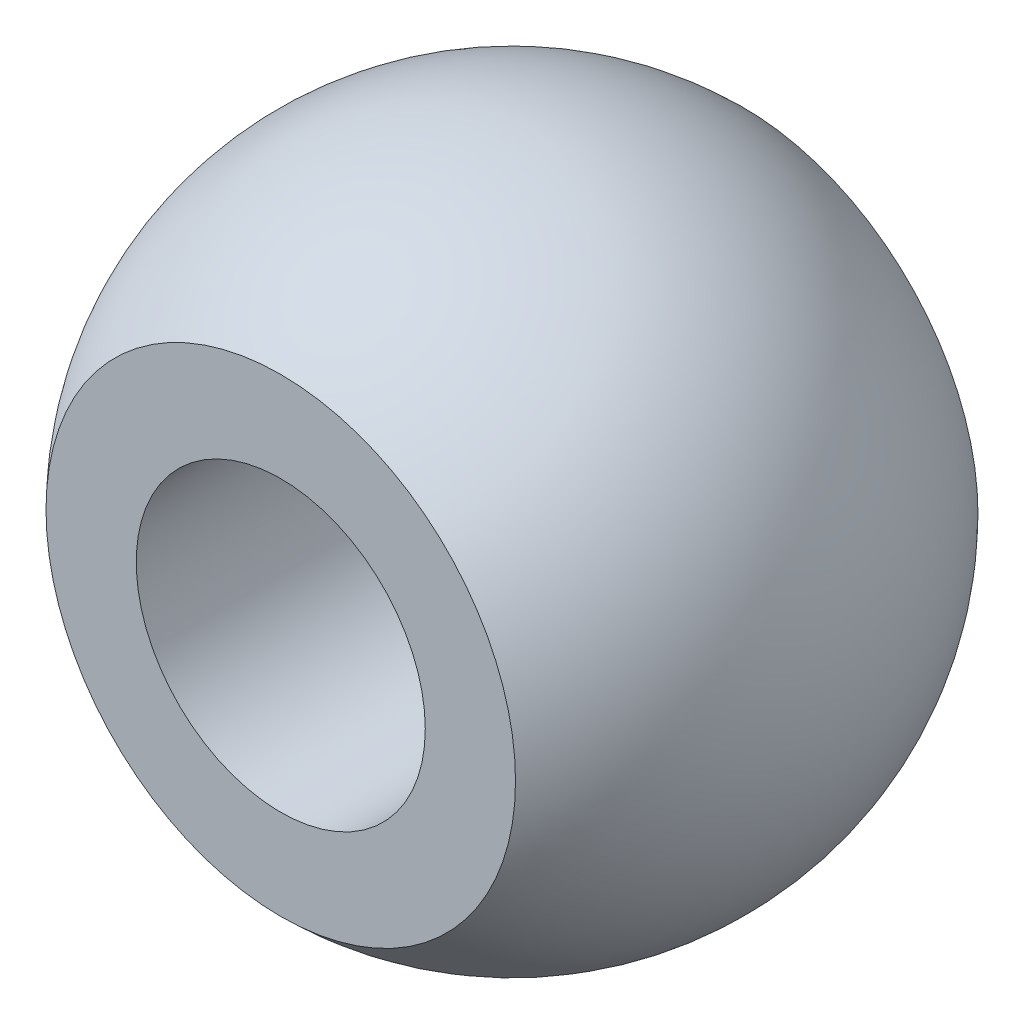
ISO-10303-21;
HEADER;
FILE_DESCRIPTION(('STEP AP214'),'2;1');
FILE_NAME('part.step','',(''),(''),'','','');
FILE_SCHEMA(('AUTOMOTIVE_DESIGN { 1 0 10303 214 1 1 1 1 }'));
ENDSEC;
DATA;
#1=APPLICATION_CONTEXT('core data for automotive mechanical design processes');
#2=APPLICATION_PROTOCOL_DEFINITION('international standard','automotive_design',2000,#1);
#3=PRODUCT_CONTEXT('',#1,'mechanical');
#4=PRODUCT('Part','Part','',(#3));
#5=PRODUCT_RELATED_PRODUCT_CATEGORY('part','',(#4));
#6=PRODUCT_DEFINITION_FORMATION('','',#4);
#7=PRODUCT_DEFINITION_CONTEXT('part definition',#1,'design');
#8=PRODUCT_DEFINITION('design','',#6,#7);
#9=PRODUCT_DEFINITION_SHAPE('','',#8);
#10=(LENGTH_UNIT() NAMED_UNIT(*) SI_UNIT(.MILLI.,.METRE.));
#11=(NAMED_UNIT(*) PLANE_ANGLE_UNIT() SI_UNIT($,.RADIAN.));
#12=(NAMED_UNIT(*) SI_UNIT($,.STERADIAN.) SOLID_ANGLE_UNIT());
#13=UNCERTAINTY_MEASURE_WITH_UNIT(LENGTH_MEASURE(1.E-05),#10,'distance_accuracy_value','');
#14=(GEOMETRIC_REPRESENTATION_CONTEXT(3) GLOBAL_UNCERTAINTY_ASSIGNED_CONTEXT((#13)) GLOBAL_UNIT_ASSIGNED_CONTEXT((#10,
#11,#12)) REPRESENTATION_CONTEXT('',''));
#15=CARTESIAN_POINT('',(0.,0.,0.));
#16=DIRECTION('',(0.,0.,1.));
#17=DIRECTION('',(1.,0.,0.));
#18=AXIS2_PLACEMENT_3D('',#15,#16,#17);
#19=CARTESIAN_POINT('',(0.,0.,0.));
#20=DIRECTION('',(0.,1.,0.));
#21=DIRECTION('',(1.,0.,0.));
#22=AXIS2_PLACEMENT_3D('',#19,#20,#21);
#23=SPHERICAL_SURFACE('',#22,5.7);
#24=CARTESIAN_POINT('',(0.,0.,0.));
#25=DIRECTION('',(0.,0.,1.));
#26=DIRECTION('',(1.,0.,0.));
#27=AXIS2_PLACEMENT_3D('',#24,#25,#26);
#28=SPHERICAL_SURFACE('',#27,5.7);
#29=CARTESIAN_POINT('',(0.,0.,-4.));
#30=DIRECTION('',(0.,0.,1.));
#31=DIRECTION('',(1.,0.,0.));
#32=AXIS2_PLACEMENT_3D('',#29,#30,#31);
#33=CIRCLE('',#32,4.06078810084939);
#34=CARTESIAN_POINT('',(4.06078810084939,0.,-4.));
#35=VERTEX_POINT('',#34);
#36=EDGE_CURVE('E37',#35,#35,#33,.F.);
#37=ORIENTED_EDGE('',*,*,#36,.F.);
#38=EDGE_LOOP('',(#37));
#39=FACE_BOUND('',#38,.T.);
#40=CARTESIAN_POINT('',(0.,0.,4.));
#41=DIRECTION('',(0.,0.,-1.));
#42=DIRECTION('',(-1.,0.,0.));
#43=AXIS2_PLACEMENT_3D('',#40,#41,#42);
#44=CIRCLE('',#43,4.06078810084939);
#45=CARTESIAN_POINT('',(-4.06078810084939,0.,4.));
#46=VERTEX_POINT('',#45);
#47=EDGE_CURVE('E10',#46,#46,#44,.F.);
#48=ORIENTED_EDGE('',*,*,#47,.F.);
#49=EDGE_LOOP('',(#48));
#50=FACE_BOUND('',#49,.T.);
#51=ADVANCED_FACE('F30',(#39,#50),#28,.T.);
#52=CARTESIAN_POINT('',(-6.32101038692015,-5.7,4.));
#53=DIRECTION('',(0.,0.,-1.));
#54=DIRECTION('',(-1.,0.,0.));
#55=AXIS2_PLACEMENT_3D('',#52,#53,#54);
#56=PLANE('',#55);
#57=CARTESIAN_POINT('',(0.,0.,4.));
#58=DIRECTION('',(0.,0.,1.));
#59=DIRECTION('',(1.,0.,0.));
#60=AXIS2_PLACEMENT_3D('',#57,#58,#59);
#61=CIRCLE('',#60,2.5);
#62=CARTESIAN_POINT('',(2.5,0.,4.));
#63=VERTEX_POINT('',#62);
#64=EDGE_CURVE('E43',#63,#63,#61,.T.);
#65=ORIENTED_EDGE('',*,*,#64,.F.);
#66=EDGE_LOOP('',(#65));
#67=FACE_BOUND('',#66,.T.);
#68=ORIENTED_EDGE('',*,*,#47,.T.);
#69=EDGE_LOOP('',(#68));
#70=FACE_BOUND('',#69,.T.);
#71=ADVANCED_FACE('F59',(#67,#70),#56,.F.);
#72=CARTESIAN_POINT('',(-6.32101038692015,-5.7,-4.));
#73=DIRECTION('',(0.,0.,1.));
#74=DIRECTION('',(1.,0.,0.));
#75=AXIS2_PLACEMENT_3D('',#72,#73,#74);
#76=PLANE('',#75);
#77=CARTESIAN_POINT('',(0.,0.,-4.));
#78=DIRECTION('',(0.,0.,1.));
#79=DIRECTION('',(1.,0.,0.));
#80=AXIS2_PLACEMENT_3D('',#77,#78,#79);
#81=CIRCLE('',#80,2.5);
#82=CARTESIAN_POINT('',(2.5,0.,-4.));
#83=VERTEX_POINT('',#82);
#84=EDGE_CURVE('E33',#83,#83,#81,.T.);
#85=ORIENTED_EDGE('',*,*,#84,.T.);
#86=EDGE_LOOP('',(#85));
#87=FACE_BOUND('',#86,.T.);
#88=ORIENTED_EDGE('',*,*,#36,.T.);
#89=EDGE_LOOP('',(#88));
#90=FACE_BOUND('',#89,.T.);
#91=ADVANCED_FACE('F50',(#87,#90),#76,.F.);
#92=CARTESIAN_POINT('',(0.,0.,-6.));
#93=DIRECTION('',(0.,0.,1.));
#94=DIRECTION('',(1.,0.,0.));
#95=AXIS2_PLACEMENT_3D('',#92,#93,#94);
#96=CYLINDRICAL_SURFACE('',#95,2.5);
#97=ORIENTED_EDGE('',*,*,#64,.T.);
#98=EDGE_LOOP('',(#97));
#99=FACE_BOUND('',#98,.T.);
#100=ORIENTED_EDGE('',*,*,#84,.F.);
#101=EDGE_LOOP('',(#100));
#102=FACE_BOUND('',#101,.T.);
#103=ADVANCED_FACE('F53',(#99,#102),#96,.F.);
#104=CLOSED_SHELL('',(#51,#71,#91,#103));
#105=MANIFOLD_SOLID_BREP('B2',#104);
#106=ADVANCED_BREP_SHAPE_REPRESENTATION('',(#18,#105),#14);
#107=SHAPE_DEFINITION_REPRESENTATION(#9,#106);
ENDSEC;
END-ISO-10303-21;
